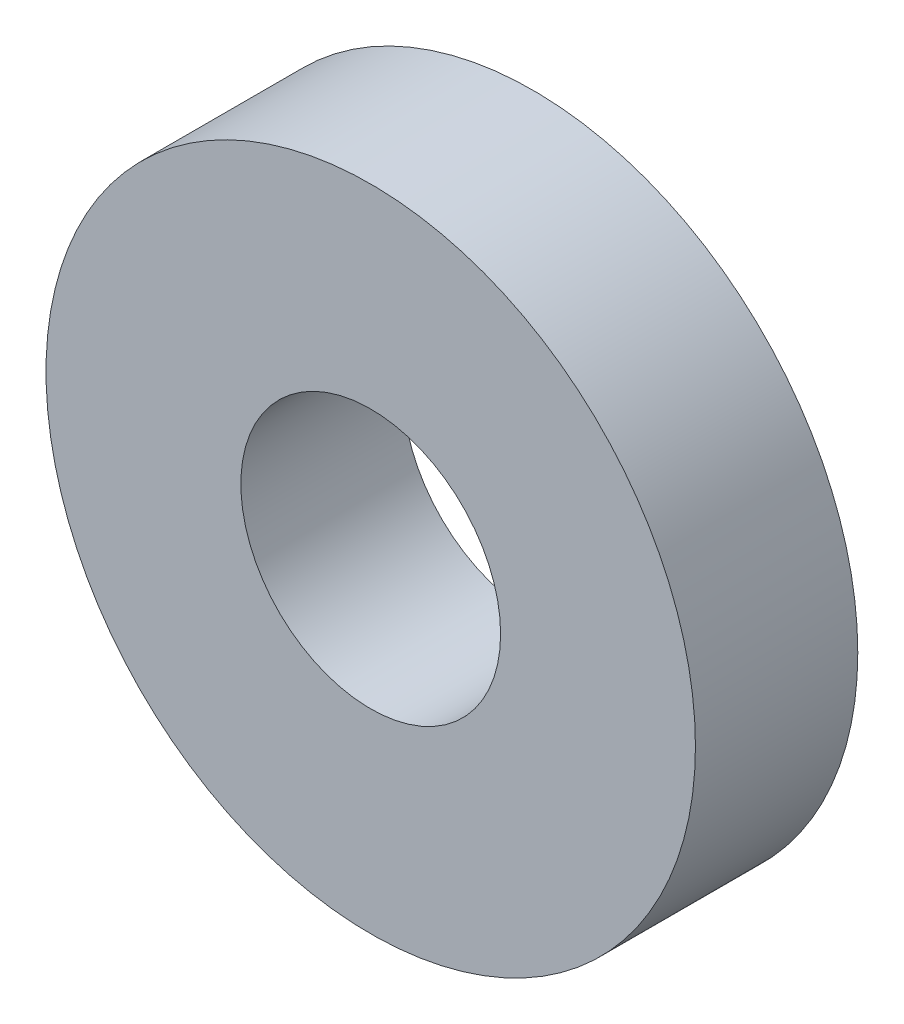
ISO-10303-21;
HEADER;
FILE_DESCRIPTION(('STEP AP214'),'2;1');
FILE_NAME('part.step','',(''),(''),'','','');
FILE_SCHEMA(('AUTOMOTIVE_DESIGN { 1 0 10303 214 1 1 1 1 }'));
ENDSEC;
DATA;
#1=APPLICATION_CONTEXT('core data for automotive mechanical design processes');
#2=APPLICATION_PROTOCOL_DEFINITION('international standard','automotive_design',2000,#1);
#3=PRODUCT_CONTEXT('',#1,'mechanical');
#4=PRODUCT('Part','Part','',(#3));
#5=PRODUCT_RELATED_PRODUCT_CATEGORY('part','',(#4));
#6=PRODUCT_DEFINITION_FORMATION('','',#4);
#7=PRODUCT_DEFINITION_CONTEXT('part definition',#1,'design');
#8=PRODUCT_DEFINITION('design','',#6,#7);
#9=PRODUCT_DEFINITION_SHAPE('','',#8);
#10=(LENGTH_UNIT() NAMED_UNIT(*) SI_UNIT(.MILLI.,.METRE.));
#11=(NAMED_UNIT(*) PLANE_ANGLE_UNIT() SI_UNIT($,.RADIAN.));
#12=(NAMED_UNIT(*) SI_UNIT($,.STERADIAN.) SOLID_ANGLE_UNIT());
#13=UNCERTAINTY_MEASURE_WITH_UNIT(LENGTH_MEASURE(1.E-05),#10,'distance_accuracy_value','');
#14=(GEOMETRIC_REPRESENTATION_CONTEXT(3) GLOBAL_UNCERTAINTY_ASSIGNED_CONTEXT((#13)) GLOBAL_UNIT_ASSIGNED_CONTEXT((#10,
#11,#12)) REPRESENTATION_CONTEXT('',''));
#15=CARTESIAN_POINT('',(0.,0.,0.));
#16=DIRECTION('',(0.,0.,1.));
#17=DIRECTION('',(1.,0.,0.));
#18=AXIS2_PLACEMENT_3D('',#15,#16,#17);
#19=CARTESIAN_POINT('',(0.,0.,5.));
#20=DIRECTION('',(0.,0.,1.));
#21=DIRECTION('',(1.,0.,0.));
#22=AXIS2_PLACEMENT_3D('',#19,#20,#21);
#23=PLANE('',#22);
#24=CARTESIAN_POINT('',(0.,0.,5.));
#25=DIRECTION('',(0.,0.,1.));
#26=DIRECTION('',(1.,0.,0.));
#27=AXIS2_PLACEMENT_3D('',#24,#25,#26);
#28=CIRCLE('',#27,10.);
#29=CARTESIAN_POINT('',(10.,0.,5.));
#30=VERTEX_POINT('',#29);
#31=EDGE_CURVE('E10',#30,#30,#28,.T.);
#32=ORIENTED_EDGE('',*,*,#31,.T.);
#33=EDGE_LOOP('',(#32));
#34=FACE_BOUND('',#33,.T.);
#35=CARTESIAN_POINT('',(0.,0.,5.));
#36=DIRECTION('',(0.,0.,1.));
#37=DIRECTION('',(1.,0.,0.));
#38=AXIS2_PLACEMENT_3D('',#35,#36,#37);
#39=CIRCLE('',#38,4.);
#40=CARTESIAN_POINT('',(4.,0.,5.));
#41=VERTEX_POINT('',#40);
#42=EDGE_CURVE('E42',#41,#41,#39,.T.);
#43=ORIENTED_EDGE('',*,*,#42,.F.);
#44=EDGE_LOOP('',(#43));
#45=FACE_BOUND('',#44,.T.);
#46=ADVANCED_FACE('F31',(#34,#45),#23,.T.);
#47=CARTESIAN_POINT('',(0.,0.,0.));
#48=DIRECTION('',(0.,0.,1.));
#49=DIRECTION('',(1.,0.,0.));
#50=AXIS2_PLACEMENT_3D('',#47,#48,#49);
#51=PLANE('',#50);
#52=CARTESIAN_POINT('',(0.,0.,0.));
#53=DIRECTION('',(0.,0.,1.));
#54=DIRECTION('',(1.,0.,0.));
#55=AXIS2_PLACEMENT_3D('',#52,#53,#54);
#56=CIRCLE('',#55,10.);
#57=CARTESIAN_POINT('',(10.,0.,0.));
#58=VERTEX_POINT('',#57);
#59=EDGE_CURVE('E35',#58,#58,#56,.T.);
#60=ORIENTED_EDGE('',*,*,#59,.F.);
#61=EDGE_LOOP('',(#60));
#62=FACE_BOUND('',#61,.T.);
#63=CARTESIAN_POINT('',(0.,0.,0.));
#64=DIRECTION('',(0.,0.,1.));
#65=DIRECTION('',(1.,0.,0.));
#66=AXIS2_PLACEMENT_3D('',#63,#64,#65);
#67=CIRCLE('',#66,4.);
#68=CARTESIAN_POINT('',(4.,0.,0.));
#69=VERTEX_POINT('',#68);
#70=EDGE_CURVE('E44',#69,#69,#67,.T.);
#71=ORIENTED_EDGE('',*,*,#70,.T.);
#72=EDGE_LOOP('',(#71));
#73=FACE_BOUND('',#72,.T.);
#74=ADVANCED_FACE('F54',(#62,#73),#51,.F.);
#75=CARTESIAN_POINT('',(0.,0.,5.));
#76=DIRECTION('',(0.,0.,-1.));
#77=DIRECTION('',(-1.,0.,0.));
#78=AXIS2_PLACEMENT_3D('',#75,#76,#77);
#79=CYLINDRICAL_SURFACE('',#78,10.);
#80=ORIENTED_EDGE('',*,*,#31,.F.);
#81=EDGE_LOOP('',(#80));
#82=FACE_BOUND('',#81,.T.);
#83=ORIENTED_EDGE('',*,*,#59,.T.);
#84=EDGE_LOOP('',(#83));
#85=FACE_BOUND('',#84,.T.);
#86=ADVANCED_FACE('F33',(#82,#85),#79,.T.);
#87=CARTESIAN_POINT('',(0.,0.,5.));
#88=DIRECTION('',(0.,0.,-1.));
#89=DIRECTION('',(-1.,0.,0.));
#90=AXIS2_PLACEMENT_3D('',#87,#88,#89);
#91=CYLINDRICAL_SURFACE('',#90,4.);
#92=ORIENTED_EDGE('',*,*,#42,.T.);
#93=EDGE_LOOP('',(#92));
#94=FACE_BOUND('',#93,.T.);
#95=ORIENTED_EDGE('',*,*,#70,.F.);
#96=EDGE_LOOP('',(#95));
#97=FACE_BOUND('',#96,.T.);
#98=ADVANCED_FACE('F50',(#94,#97),#91,.F.);
#99=CLOSED_SHELL('',(#46,#74,#86,#98));
#100=MANIFOLD_SOLID_BREP('B2',#99);
#101=ADVANCED_BREP_SHAPE_REPRESENTATION('',(#18,#100),#14);
#102=SHAPE_DEFINITION_REPRESENTATION(#9,#101);
ENDSEC;
END-ISO-10303-21;
